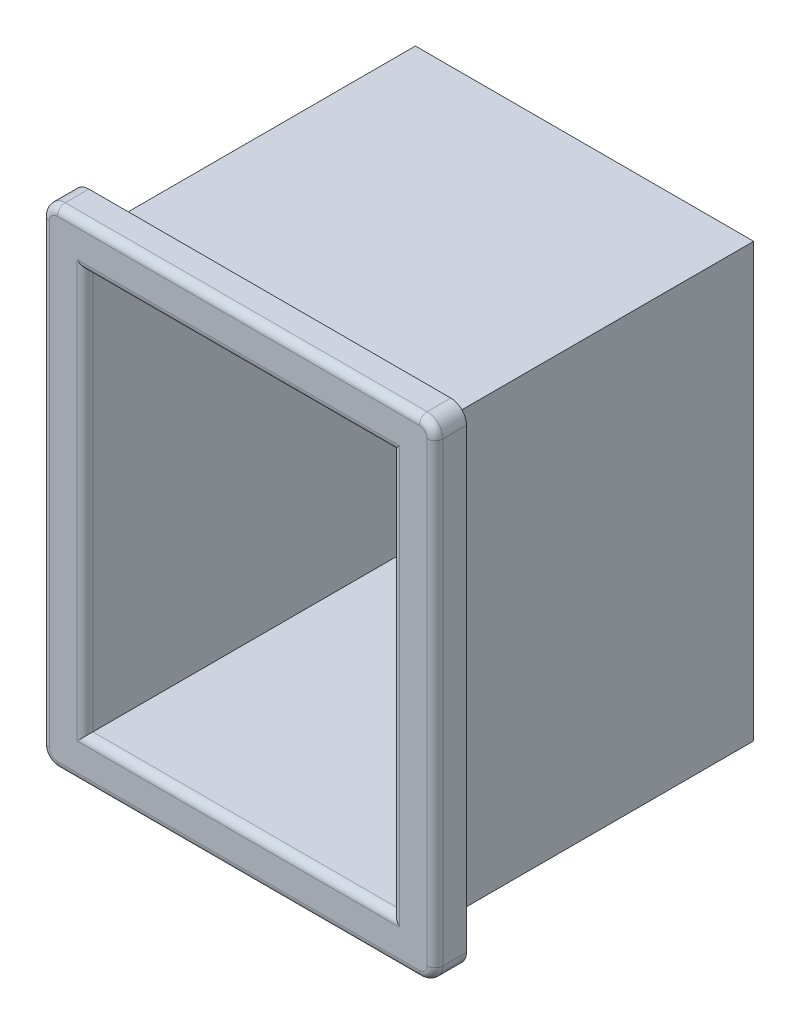
ISO-10303-21;
HEADER;
FILE_DESCRIPTION(('STEP AP214'),'2;1');
FILE_NAME('part.step','',(''),(''),'','','');
FILE_SCHEMA(('AUTOMOTIVE_DESIGN { 1 0 10303 214 1 1 1 1 }'));
ENDSEC;
DATA;
#1=APPLICATION_CONTEXT('core data for automotive mechanical design processes');
#2=APPLICATION_PROTOCOL_DEFINITION('international standard','automotive_design',2000,#1);
#3=PRODUCT_CONTEXT('',#1,'mechanical');
#4=PRODUCT('Part','Part','',(#3));
#5=PRODUCT_RELATED_PRODUCT_CATEGORY('part','',(#4));
#6=PRODUCT_DEFINITION_FORMATION('','',#4);
#7=PRODUCT_DEFINITION_CONTEXT('part definition',#1,'design');
#8=PRODUCT_DEFINITION('design','',#6,#7);
#9=PRODUCT_DEFINITION_SHAPE('','',#8);
#10=(LENGTH_UNIT() NAMED_UNIT(*) SI_UNIT(.MILLI.,.METRE.));
#11=(NAMED_UNIT(*) PLANE_ANGLE_UNIT() SI_UNIT($,.RADIAN.));
#12=(NAMED_UNIT(*) SI_UNIT($,.STERADIAN.) SOLID_ANGLE_UNIT());
#13=UNCERTAINTY_MEASURE_WITH_UNIT(LENGTH_MEASURE(1.E-05),#10,'distance_accuracy_value','');
#14=(GEOMETRIC_REPRESENTATION_CONTEXT(3) GLOBAL_UNCERTAINTY_ASSIGNED_CONTEXT((#13)) GLOBAL_UNIT_ASSIGNED_CONTEXT((#10,
#11,#12)) REPRESENTATION_CONTEXT('',''));
#15=CARTESIAN_POINT('',(0.,0.,0.));
#16=DIRECTION('',(0.,0.,1.));
#17=DIRECTION('',(1.,0.,0.));
#18=AXIS2_PLACEMENT_3D('',#15,#16,#17);
#19=CARTESIAN_POINT('',(10.75,13.75,20.));
#20=DIRECTION('',(-1.,0.,0.));
#21=DIRECTION('',(0.,-1.,0.));
#22=AXIS2_PLACEMENT_3D('',#19,#20,#21);
#23=PLANE('',#22);
#24=DIRECTION('',(0.,1.,0.));
#25=VECTOR('',#24,1.);
#26=CARTESIAN_POINT('',(10.75,13.75,0.));
#27=LINE('',#26,#25);
#28=CARTESIAN_POINT('',(10.75,-13.75,0.));
#29=VERTEX_POINT('',#28);
#30=CARTESIAN_POINT('',(10.75,13.75,0.));
#31=VERTEX_POINT('',#30);
#32=EDGE_CURVE('E229',#29,#31,#27,.T.);
#33=ORIENTED_EDGE('',*,*,#32,.T.);
#34=DIRECTION('',(0.,0.,-1.));
#35=VECTOR('',#34,1.);
#36=CARTESIAN_POINT('',(10.75,13.75,20.));
#37=LINE('',#36,#35);
#38=CARTESIAN_POINT('',(10.75,13.75,20.));
#39=VERTEX_POINT('',#38);
#40=EDGE_CURVE('E259',#39,#31,#37,.T.);
#41=ORIENTED_EDGE('',*,*,#40,.F.);
#42=DIRECTION('',(0.,1.,0.));
#43=VECTOR('',#42,1.);
#44=CARTESIAN_POINT('',(10.75,13.75,20.));
#45=LINE('',#44,#43);
#46=CARTESIAN_POINT('',(10.75,-13.75,20.));
#47=VERTEX_POINT('',#46);
#48=EDGE_CURVE('E230',#47,#39,#45,.T.);
#49=ORIENTED_EDGE('',*,*,#48,.F.);
#50=DIRECTION('',(0.,0.,-1.));
#51=VECTOR('',#50,1.);
#52=CARTESIAN_POINT('',(10.75,-13.75,20.));
#53=LINE('',#52,#51);
#54=EDGE_CURVE('E243',#47,#29,#53,.T.);
#55=ORIENTED_EDGE('',*,*,#54,.T.);
#56=EDGE_LOOP('',(#33,#41,#49,#55));
#57=FACE_BOUND('',#56,.T.);
#58=ADVANCED_FACE('F34',(#57),#23,.F.);
#59=CARTESIAN_POINT('',(-10.75,13.75,20.));
#60=DIRECTION('',(0.,-1.,0.));
#61=DIRECTION('',(0.,0.,-1.));
#62=AXIS2_PLACEMENT_3D('',#59,#60,#61);
#63=PLANE('',#62);
#64=DIRECTION('',(-1.,0.,0.));
#65=VECTOR('',#64,1.);
#66=CARTESIAN_POINT('',(-10.75,13.75,0.));
#67=LINE('',#66,#65);
#68=CARTESIAN_POINT('',(-10.75,13.75,0.));
#69=VERTEX_POINT('',#68);
#70=EDGE_CURVE('E246',#31,#69,#67,.T.);
#71=ORIENTED_EDGE('',*,*,#70,.T.);
#72=DIRECTION('',(0.,0.,-1.));
#73=VECTOR('',#72,1.);
#74=CARTESIAN_POINT('',(-10.75,13.75,20.));
#75=LINE('',#74,#73);
#76=CARTESIAN_POINT('',(-10.75,13.75,20.));
#77=VERTEX_POINT('',#76);
#78=EDGE_CURVE('E256',#77,#69,#75,.T.);
#79=ORIENTED_EDGE('',*,*,#78,.F.);
#80=DIRECTION('',(-1.,0.,0.));
#81=VECTOR('',#80,1.);
#82=CARTESIAN_POINT('',(-10.75,13.75,20.));
#83=LINE('',#82,#81);
#84=EDGE_CURVE('E233',#39,#77,#83,.T.);
#85=ORIENTED_EDGE('',*,*,#84,.F.);
#86=ORIENTED_EDGE('',*,*,#40,.T.);
#87=EDGE_LOOP('',(#71,#79,#85,#86));
#88=FACE_BOUND('',#87,.T.);
#89=ADVANCED_FACE('F394',(#88),#63,.F.);
#90=CARTESIAN_POINT('',(-10.75,13.75,20.));
#91=DIRECTION('',(1.,0.,0.));
#92=DIRECTION('',(0.,1.,0.));
#93=AXIS2_PLACEMENT_3D('',#90,#91,#92);
#94=PLANE('',#93);
#95=DIRECTION('',(0.,-1.,0.));
#96=VECTOR('',#95,1.);
#97=CARTESIAN_POINT('',(-10.75,13.75,0.));
#98=LINE('',#97,#96);
#99=CARTESIAN_POINT('',(-10.75,-13.75,0.));
#100=VERTEX_POINT('',#99);
#101=EDGE_CURVE('E248',#69,#100,#98,.T.);
#102=ORIENTED_EDGE('',*,*,#101,.T.);
#103=DIRECTION('',(0.,0.,-1.));
#104=VECTOR('',#103,1.);
#105=CARTESIAN_POINT('',(-10.75,-13.75,20.));
#106=LINE('',#105,#104);
#107=CARTESIAN_POINT('',(-10.75,-13.75,20.));
#108=VERTEX_POINT('',#107);
#109=EDGE_CURVE('E253',#108,#100,#106,.T.);
#110=ORIENTED_EDGE('',*,*,#109,.F.);
#111=DIRECTION('',(0.,-1.,0.));
#112=VECTOR('',#111,1.);
#113=CARTESIAN_POINT('',(-10.75,13.75,20.));
#114=LINE('',#113,#112);
#115=EDGE_CURVE('E237',#77,#108,#114,.T.);
#116=ORIENTED_EDGE('',*,*,#115,.F.);
#117=ORIENTED_EDGE('',*,*,#78,.T.);
#118=EDGE_LOOP('',(#102,#110,#116,#117));
#119=FACE_BOUND('',#118,.T.);
#120=ADVANCED_FACE('F400',(#119),#94,.F.);
#121=CARTESIAN_POINT('',(-10.75,-13.75,20.));
#122=DIRECTION('',(0.,1.,0.));
#123=DIRECTION('',(0.,0.,1.));
#124=AXIS2_PLACEMENT_3D('',#121,#122,#123);
#125=PLANE('',#124);
#126=DIRECTION('',(1.,0.,0.));
#127=VECTOR('',#126,1.);
#128=CARTESIAN_POINT('',(-10.75,-13.75,0.));
#129=LINE('',#128,#127);
#130=EDGE_CURVE('E234',#100,#29,#129,.T.);
#131=ORIENTED_EDGE('',*,*,#130,.T.);
#132=ORIENTED_EDGE('',*,*,#54,.F.);
#133=DIRECTION('',(1.,0.,0.));
#134=VECTOR('',#133,1.);
#135=CARTESIAN_POINT('',(-10.75,-13.75,20.));
#136=LINE('',#135,#134);
#137=EDGE_CURVE('E240',#108,#47,#136,.T.);
#138=ORIENTED_EDGE('',*,*,#137,.F.);
#139=ORIENTED_EDGE('',*,*,#109,.T.);
#140=EDGE_LOOP('',(#131,#132,#138,#139));
#141=FACE_BOUND('',#140,.T.);
#142=ADVANCED_FACE('F604',(#141),#125,.F.);
#143=CARTESIAN_POINT('',(0.,0.,0.));
#144=DIRECTION('',(0.,0.,1.));
#145=DIRECTION('',(1.,0.,0.));
#146=AXIS2_PLACEMENT_3D('',#143,#144,#145);
#147=PLANE('',#146);
#148=ORIENTED_EDGE('',*,*,#32,.F.);
#149=ORIENTED_EDGE('',*,*,#130,.F.);
#150=ORIENTED_EDGE('',*,*,#101,.F.);
#151=ORIENTED_EDGE('',*,*,#70,.F.);
#152=EDGE_LOOP('',(#148,#149,#150,#151));
#153=FACE_BOUND('',#152,.T.);
#154=ADVANCED_FACE('F587',(#153),#147,.F.);
#155=CARTESIAN_POINT('',(12.5,-15.5,22.));
#156=DIRECTION('',(-1.,0.,0.));
#157=DIRECTION('',(0.,0.,1.));
#158=AXIS2_PLACEMENT_3D('',#155,#156,#157);
#159=PLANE('',#158);
#160=DIRECTION('',(0.,0.,-1.));
#161=VECTOR('',#160,1.);
#162=CARTESIAN_POINT('',(12.5,14.5,22.));
#163=LINE('',#162,#161);
#164=CARTESIAN_POINT('',(12.5,14.5,20.));
#165=VERTEX_POINT('',#164);
#166=CARTESIAN_POINT('',(12.5,14.5,21.5));
#167=VERTEX_POINT('',#166);
#168=EDGE_CURVE('E280',#165,#167,#163,.F.);
#169=ORIENTED_EDGE('',*,*,#168,.T.);
#170=DIRECTION('',(0.,1.,0.));
#171=VECTOR('',#170,1.);
#172=CARTESIAN_POINT('',(12.5,-15.5,21.5));
#173=LINE('',#172,#171);
#174=CARTESIAN_POINT('',(12.5,-14.5,21.5));
#175=VERTEX_POINT('',#174);
#176=EDGE_CURVE('E323',#167,#175,#173,.F.);
#177=ORIENTED_EDGE('',*,*,#176,.T.);
#178=DIRECTION('',(0.,0.,-1.));
#179=VECTOR('',#178,1.);
#180=CARTESIAN_POINT('',(12.5,-14.5,22.));
#181=LINE('',#180,#179);
#182=CARTESIAN_POINT('',(12.5,-14.5,20.));
#183=VERTEX_POINT('',#182);
#184=EDGE_CURVE('E283',#175,#183,#181,.T.);
#185=ORIENTED_EDGE('',*,*,#184,.T.);
#186=DIRECTION('',(0.,1.,0.));
#187=VECTOR('',#186,1.);
#188=CARTESIAN_POINT('',(12.5,-15.5,20.));
#189=LINE('',#188,#187);
#190=EDGE_CURVE('E214',#183,#165,#189,.T.);
#191=ORIENTED_EDGE('',*,*,#190,.T.);
#192=EDGE_LOOP('',(#169,#177,#185,#191));
#193=FACE_BOUND('',#192,.T.);
#194=ADVANCED_FACE('F578',(#193),#159,.F.);
#195=CARTESIAN_POINT('',(-12.5,15.5,22.));
#196=DIRECTION('',(0.,-1.,0.));
#197=DIRECTION('',(0.,0.,-1.));
#198=AXIS2_PLACEMENT_3D('',#195,#196,#197);
#199=PLANE('',#198);
#200=DIRECTION('',(0.,0.,-1.));
#201=VECTOR('',#200,1.);
#202=CARTESIAN_POINT('',(-11.5,15.5,22.));
#203=LINE('',#202,#201);
#204=CARTESIAN_POINT('',(-11.5,15.5,20.));
#205=VERTEX_POINT('',#204);
#206=CARTESIAN_POINT('',(-11.5,15.5,21.5));
#207=VERTEX_POINT('',#206);
#208=EDGE_CURVE('E287',#205,#207,#203,.F.);
#209=ORIENTED_EDGE('',*,*,#208,.T.);
#210=DIRECTION('',(-1.,0.,0.));
#211=VECTOR('',#210,1.);
#212=CARTESIAN_POINT('',(-12.5,15.5,21.5));
#213=LINE('',#212,#211);
#214=CARTESIAN_POINT('',(11.5,15.5,21.5));
#215=VERTEX_POINT('',#214);
#216=EDGE_CURVE('E319',#207,#215,#213,.F.);
#217=ORIENTED_EDGE('',*,*,#216,.T.);
#218=DIRECTION('',(0.,0.,-1.));
#219=VECTOR('',#218,1.);
#220=CARTESIAN_POINT('',(11.5,15.5,22.));
#221=LINE('',#220,#219);
#222=CARTESIAN_POINT('',(11.5,15.5,20.));
#223=VERTEX_POINT('',#222);
#224=EDGE_CURVE('E285',#215,#223,#221,.T.);
#225=ORIENTED_EDGE('',*,*,#224,.T.);
#226=DIRECTION('',(-1.,0.,0.));
#227=VECTOR('',#226,1.);
#228=CARTESIAN_POINT('',(-12.5,15.5,20.));
#229=LINE('',#228,#227);
#230=EDGE_CURVE('E220',#223,#205,#229,.T.);
#231=ORIENTED_EDGE('',*,*,#230,.T.);
#232=EDGE_LOOP('',(#209,#217,#225,#231));
#233=FACE_BOUND('',#232,.T.);
#234=ADVANCED_FACE('F568',(#233),#199,.F.);
#235=CARTESIAN_POINT('',(-12.5,-15.5,22.));
#236=DIRECTION('',(1.,0.,0.));
#237=DIRECTION('',(0.,0.,-1.));
#238=AXIS2_PLACEMENT_3D('',#235,#236,#237);
#239=PLANE('',#238);
#240=DIRECTION('',(0.,0.,-1.));
#241=VECTOR('',#240,1.);
#242=CARTESIAN_POINT('',(-12.5,-14.5,22.));
#243=LINE('',#242,#241);
#244=CARTESIAN_POINT('',(-12.5,-14.5,20.));
#245=VERTEX_POINT('',#244);
#246=CARTESIAN_POINT('',(-12.5,-14.5,21.5));
#247=VERTEX_POINT('',#246);
#248=EDGE_CURVE('E277',#245,#247,#243,.F.);
#249=ORIENTED_EDGE('',*,*,#248,.T.);
#250=DIRECTION('',(0.,-1.,0.));
#251=VECTOR('',#250,1.);
#252=CARTESIAN_POINT('',(-12.5,-15.5,21.5));
#253=LINE('',#252,#251);
#254=CARTESIAN_POINT('',(-12.5,14.5,21.5));
#255=VERTEX_POINT('',#254);
#256=EDGE_CURVE('E331',#247,#255,#253,.F.);
#257=ORIENTED_EDGE('',*,*,#256,.T.);
#258=DIRECTION('',(0.,0.,-1.));
#259=VECTOR('',#258,1.);
#260=CARTESIAN_POINT('',(-12.5,14.5,22.));
#261=LINE('',#260,#259);
#262=CARTESIAN_POINT('',(-12.5,14.5,20.));
#263=VERTEX_POINT('',#262);
#264=EDGE_CURVE('E275',#255,#263,#261,.T.);
#265=ORIENTED_EDGE('',*,*,#264,.T.);
#266=DIRECTION('',(0.,-1.,0.));
#267=VECTOR('',#266,1.);
#268=CARTESIAN_POINT('',(-12.5,-15.5,20.));
#269=LINE('',#268,#267);
#270=EDGE_CURVE('E223',#263,#245,#269,.T.);
#271=ORIENTED_EDGE('',*,*,#270,.T.);
#272=EDGE_LOOP('',(#249,#257,#265,#271));
#273=FACE_BOUND('',#272,.T.);
#274=ADVANCED_FACE('F558',(#273),#239,.F.);
#275=CARTESIAN_POINT('',(-12.5,-15.5,22.));
#276=DIRECTION('',(0.,1.,0.));
#277=DIRECTION('',(0.,0.,1.));
#278=AXIS2_PLACEMENT_3D('',#275,#276,#277);
#279=PLANE('',#278);
#280=DIRECTION('',(0.,0.,-1.));
#281=VECTOR('',#280,1.);
#282=CARTESIAN_POINT('',(11.5,-15.5,22.));
#283=LINE('',#282,#281);
#284=CARTESIAN_POINT('',(11.5,-15.5,20.));
#285=VERTEX_POINT('',#284);
#286=CARTESIAN_POINT('',(11.5,-15.5,21.5));
#287=VERTEX_POINT('',#286);
#288=EDGE_CURVE('E262',#285,#287,#283,.F.);
#289=ORIENTED_EDGE('',*,*,#288,.T.);
#290=DIRECTION('',(1.,0.,0.));
#291=VECTOR('',#290,1.);
#292=CARTESIAN_POINT('',(-12.5,-15.5,21.5));
#293=LINE('',#292,#291);
#294=CARTESIAN_POINT('',(-11.5,-15.5,21.5));
#295=VERTEX_POINT('',#294);
#296=EDGE_CURVE('E327',#287,#295,#293,.F.);
#297=ORIENTED_EDGE('',*,*,#296,.T.);
#298=DIRECTION('',(0.,0.,-1.));
#299=VECTOR('',#298,1.);
#300=CARTESIAN_POINT('',(-11.5,-15.5,22.));
#301=LINE('',#300,#299);
#302=CARTESIAN_POINT('',(-11.5,-15.5,20.));
#303=VERTEX_POINT('',#302);
#304=EDGE_CURVE('E265',#295,#303,#301,.T.);
#305=ORIENTED_EDGE('',*,*,#304,.T.);
#306=DIRECTION('',(1.,0.,0.));
#307=VECTOR('',#306,1.);
#308=CARTESIAN_POINT('',(-12.5,-15.5,20.));
#309=LINE('',#308,#307);
#310=EDGE_CURVE('E226',#303,#285,#309,.T.);
#311=ORIENTED_EDGE('',*,*,#310,.T.);
#312=EDGE_LOOP('',(#289,#297,#305,#311));
#313=FACE_BOUND('',#312,.T.);
#314=ADVANCED_FACE('F548',(#313),#279,.F.);
#315=CARTESIAN_POINT('',(0.,0.,22.));
#316=DIRECTION('',(0.,0.,-1.));
#317=DIRECTION('',(-1.,0.,0.));
#318=AXIS2_PLACEMENT_3D('',#315,#316,#317);
#319=PLANE('',#318);
#320=DIRECTION('',(-1.,0.,0.));
#321=VECTOR('',#320,1.);
#322=CARTESIAN_POINT('',(0.,15.,22.));
#323=LINE('',#322,#321);
#324=CARTESIAN_POINT('',(11.5,15.,22.));
#325=VERTEX_POINT('',#324);
#326=CARTESIAN_POINT('',(-11.5,15.,22.));
#327=VERTEX_POINT('',#326);
#328=EDGE_CURVE('E311',#325,#327,#323,.T.);
#329=ORIENTED_EDGE('',*,*,#328,.T.);
#330=CARTESIAN_POINT('',(-11.5,14.5,22.));
#331=DIRECTION('',(0.,0.,-1.));
#332=DIRECTION('',(-1.,0.,0.));
#333=AXIS2_PLACEMENT_3D('',#330,#331,#332);
#334=CIRCLE('',#333,0.5);
#335=CARTESIAN_POINT('',(-12.,14.5,22.));
#336=VERTEX_POINT('',#335);
#337=EDGE_CURVE('E313',#327,#336,#334,.F.);
#338=ORIENTED_EDGE('',*,*,#337,.T.);
#339=DIRECTION('',(0.,-1.,0.));
#340=VECTOR('',#339,1.);
#341=CARTESIAN_POINT('',(-12.,0.,22.));
#342=LINE('',#341,#340);
#343=CARTESIAN_POINT('',(-12.,-14.5,22.));
#344=VERTEX_POINT('',#343);
#345=EDGE_CURVE('E299',#336,#344,#342,.T.);
#346=ORIENTED_EDGE('',*,*,#345,.T.);
#347=CARTESIAN_POINT('',(-11.5,-14.5,22.));
#348=DIRECTION('',(0.,0.,-1.));
#349=DIRECTION('',(-1.,0.,0.));
#350=AXIS2_PLACEMENT_3D('',#347,#348,#349);
#351=CIRCLE('',#350,0.5);
#352=CARTESIAN_POINT('',(-11.5,-15.,22.));
#353=VERTEX_POINT('',#352);
#354=EDGE_CURVE('E301',#344,#353,#351,.F.);
#355=ORIENTED_EDGE('',*,*,#354,.T.);
#356=DIRECTION('',(1.,0.,0.));
#357=VECTOR('',#356,1.);
#358=CARTESIAN_POINT('',(0.,-15.,22.));
#359=LINE('',#358,#357);
#360=CARTESIAN_POINT('',(11.5,-15.,22.));
#361=VERTEX_POINT('',#360);
#362=EDGE_CURVE('E303',#353,#361,#359,.T.);
#363=ORIENTED_EDGE('',*,*,#362,.T.);
#364=CARTESIAN_POINT('',(11.5,-14.5,22.));
#365=DIRECTION('',(0.,0.,-1.));
#366=DIRECTION('',(-1.,0.,0.));
#367=AXIS2_PLACEMENT_3D('',#364,#365,#366);
#368=CIRCLE('',#367,0.5);
#369=CARTESIAN_POINT('',(12.,-14.5,22.));
#370=VERTEX_POINT('',#369);
#371=EDGE_CURVE('E305',#361,#370,#368,.F.);
#372=ORIENTED_EDGE('',*,*,#371,.T.);
#373=DIRECTION('',(0.,1.,0.));
#374=VECTOR('',#373,1.);
#375=CARTESIAN_POINT('',(12.,0.,22.));
#376=LINE('',#375,#374);
#377=CARTESIAN_POINT('',(12.,14.5,22.));
#378=VERTEX_POINT('',#377);
#379=EDGE_CURVE('E307',#370,#378,#376,.T.);
#380=ORIENTED_EDGE('',*,*,#379,.T.);
#381=CARTESIAN_POINT('',(11.5,14.5,22.));
#382=DIRECTION('',(0.,0.,-1.));
#383=DIRECTION('',(-1.,0.,0.));
#384=AXIS2_PLACEMENT_3D('',#381,#382,#383);
#385=CIRCLE('',#384,0.5);
#386=EDGE_CURVE('E309',#378,#325,#385,.F.);
#387=ORIENTED_EDGE('',*,*,#386,.T.);
#388=EDGE_LOOP('',(#329,#338,#346,#355,#363,#372,#380,#387));
#389=FACE_BOUND('',#388,.T.);
#390=DIRECTION('',(1.,0.,0.));
#391=VECTOR('',#390,1.);
#392=CARTESIAN_POINT('',(0.,-13.25,22.));
#393=LINE('',#392,#391);
#394=CARTESIAN_POINT('',(10.25,-13.25,22.));
#395=VERTEX_POINT('',#394);
#396=CARTESIAN_POINT('',(-10.25,-13.25,22.));
#397=VERTEX_POINT('',#396);
#398=EDGE_CURVE('E294',#395,#397,#393,.F.);
#399=ORIENTED_EDGE('',*,*,#398,.T.);
#400=DIRECTION('',(0.,-1.,0.));
#401=VECTOR('',#400,1.);
#402=CARTESIAN_POINT('',(-10.25,0.,22.));
#403=LINE('',#402,#401);
#404=CARTESIAN_POINT('',(-10.25,13.25,22.));
#405=VERTEX_POINT('',#404);
#406=EDGE_CURVE('E296',#397,#405,#403,.F.);
#407=ORIENTED_EDGE('',*,*,#406,.T.);
#408=DIRECTION('',(-1.,0.,0.));
#409=VECTOR('',#408,1.);
#410=CARTESIAN_POINT('',(0.,13.25,22.));
#411=LINE('',#410,#409);
#412=CARTESIAN_POINT('',(10.25,13.25,22.));
#413=VERTEX_POINT('',#412);
#414=EDGE_CURVE('E290',#405,#413,#411,.F.);
#415=ORIENTED_EDGE('',*,*,#414,.T.);
#416=DIRECTION('',(0.,1.,0.));
#417=VECTOR('',#416,1.);
#418=CARTESIAN_POINT('',(10.25,0.,22.));
#419=LINE('',#418,#417);
#420=EDGE_CURVE('E292',#413,#395,#419,.F.);
#421=ORIENTED_EDGE('',*,*,#420,.T.);
#422=EDGE_LOOP('',(#399,#407,#415,#421));
#423=FACE_BOUND('',#422,.T.);
#424=ADVANCED_FACE('F373',(#389,#423),#319,.F.);
#425=CARTESIAN_POINT('',(0.,0.,20.));
#426=DIRECTION('',(0.,0.,-1.));
#427=DIRECTION('',(-1.,0.,0.));
#428=AXIS2_PLACEMENT_3D('',#425,#426,#427);
#429=PLANE('',#428);
#430=ORIENTED_EDGE('',*,*,#137,.T.);
#431=ORIENTED_EDGE('',*,*,#48,.T.);
#432=ORIENTED_EDGE('',*,*,#84,.T.);
#433=ORIENTED_EDGE('',*,*,#115,.T.);
#434=EDGE_LOOP('',(#430,#431,#432,#433));
#435=FACE_BOUND('',#434,.T.);
#436=ORIENTED_EDGE('',*,*,#310,.F.);
#437=CARTESIAN_POINT('',(-11.5,-14.5,20.));
#438=DIRECTION('',(0.,0.,-1.));
#439=DIRECTION('',(-1.,0.,0.));
#440=AXIS2_PLACEMENT_3D('',#437,#438,#439);
#441=CIRCLE('',#440,1.);
#442=EDGE_CURVE('E273',#303,#245,#441,.T.);
#443=ORIENTED_EDGE('',*,*,#442,.T.);
#444=ORIENTED_EDGE('',*,*,#270,.F.);
#445=CARTESIAN_POINT('',(-11.5,14.5,20.));
#446=DIRECTION('',(0.,0.,-1.));
#447=DIRECTION('',(-1.,0.,0.));
#448=AXIS2_PLACEMENT_3D('',#445,#446,#447);
#449=CIRCLE('',#448,1.);
#450=EDGE_CURVE('E269',#263,#205,#449,.T.);
#451=ORIENTED_EDGE('',*,*,#450,.T.);
#452=ORIENTED_EDGE('',*,*,#230,.F.);
#453=CARTESIAN_POINT('',(11.5,14.5,20.));
#454=DIRECTION('',(0.,0.,-1.));
#455=DIRECTION('',(-1.,0.,0.));
#456=AXIS2_PLACEMENT_3D('',#453,#454,#455);
#457=CIRCLE('',#456,1.);
#458=EDGE_CURVE('E267',#223,#165,#457,.T.);
#459=ORIENTED_EDGE('',*,*,#458,.T.);
#460=ORIENTED_EDGE('',*,*,#190,.F.);
#461=CARTESIAN_POINT('',(11.5,-14.5,20.));
#462=DIRECTION('',(0.,0.,-1.));
#463=DIRECTION('',(-1.,0.,0.));
#464=AXIS2_PLACEMENT_3D('',#461,#462,#463);
#465=CIRCLE('',#464,1.);
#466=EDGE_CURVE('E271',#183,#285,#465,.T.);
#467=ORIENTED_EDGE('',*,*,#466,.T.);
#468=EDGE_LOOP('',(#436,#443,#444,#451,#452,#459,#460,#467));
#469=FACE_BOUND('',#468,.T.);
#470=ADVANCED_FACE('F390',(#435,#469),#429,.T.);
#471=CARTESIAN_POINT('',(9.75,-12.75,0.999999999999997));
#472=DIRECTION('',(1.,0.,0.));
#473=DIRECTION('',(0.,0.,-1.));
#474=AXIS2_PLACEMENT_3D('',#471,#472,#473);
#475=PLANE('',#474);
#476=DIRECTION('',(0.,0.,1.));
#477=VECTOR('',#476,1.);
#478=CARTESIAN_POINT('',(9.75,-12.75,0.999999999999997));
#479=LINE('',#478,#477);
#480=CARTESIAN_POINT('',(9.75,-12.75,0.999999999999997));
#481=VERTEX_POINT('',#480);
#482=CARTESIAN_POINT('',(9.75,-12.75,21.5));
#483=VERTEX_POINT('',#482);
#484=EDGE_CURVE('E212',#481,#483,#479,.T.);
#485=ORIENTED_EDGE('',*,*,#484,.T.);
#486=DIRECTION('',(0.,1.,0.));
#487=VECTOR('',#486,1.);
#488=CARTESIAN_POINT('',(9.75,-12.75,21.5));
#489=LINE('',#488,#487);
#490=CARTESIAN_POINT('',(9.75,12.75,21.5));
#491=VERTEX_POINT('',#490);
#492=EDGE_CURVE('E43',#483,#491,#489,.T.);
#493=ORIENTED_EDGE('',*,*,#492,.T.);
#494=DIRECTION('',(0.,0.,1.));
#495=VECTOR('',#494,1.);
#496=CARTESIAN_POINT('',(9.75,12.75,0.999999999999997));
#497=LINE('',#496,#495);
#498=CARTESIAN_POINT('',(9.75,12.75,0.999999999999997));
#499=VERTEX_POINT('',#498);
#500=EDGE_CURVE('E182',#499,#491,#497,.T.);
#501=ORIENTED_EDGE('',*,*,#500,.F.);
#502=DIRECTION('',(0.,1.,0.));
#503=VECTOR('',#502,1.);
#504=CARTESIAN_POINT('',(9.75,-12.75,0.999999999999997));
#505=LINE('',#504,#503);
#506=EDGE_CURVE('E186',#481,#499,#505,.T.);
#507=ORIENTED_EDGE('',*,*,#506,.F.);
#508=EDGE_LOOP('',(#485,#493,#501,#507));
#509=FACE_BOUND('',#508,.T.);
#510=ADVANCED_FACE('F184',(#509),#475,.F.);
#511=CARTESIAN_POINT('',(-9.75,-12.75,0.999999999999997));
#512=DIRECTION('',(0.,-1.,0.));
#513=DIRECTION('',(0.,0.,-1.));
#514=AXIS2_PLACEMENT_3D('',#511,#512,#513);
#515=PLANE('',#514);
#516=DIRECTION('',(0.,0.,1.));
#517=VECTOR('',#516,1.);
#518=CARTESIAN_POINT('',(-9.75,-12.75,0.999999999999997));
#519=LINE('',#518,#517);
#520=CARTESIAN_POINT('',(-9.75,-12.75,0.999999999999997));
#521=VERTEX_POINT('',#520);
#522=CARTESIAN_POINT('',(-9.75,-12.75,21.5));
#523=VERTEX_POINT('',#522);
#524=EDGE_CURVE('E215',#521,#523,#519,.T.);
#525=ORIENTED_EDGE('',*,*,#524,.T.);
#526=DIRECTION('',(1.,0.,0.));
#527=VECTOR('',#526,1.);
#528=CARTESIAN_POINT('',(-9.75,-12.75,21.5));
#529=LINE('',#528,#527);
#530=EDGE_CURVE('E58',#523,#483,#529,.T.);
#531=ORIENTED_EDGE('',*,*,#530,.T.);
#532=ORIENTED_EDGE('',*,*,#484,.F.);
#533=DIRECTION('',(1.,0.,0.));
#534=VECTOR('',#533,1.);
#535=CARTESIAN_POINT('',(-9.75,-12.75,0.999999999999997));
#536=LINE('',#535,#534);
#537=EDGE_CURVE('E191',#521,#481,#536,.T.);
#538=ORIENTED_EDGE('',*,*,#537,.F.);
#539=EDGE_LOOP('',(#525,#531,#532,#538));
#540=FACE_BOUND('',#539,.T.);
#541=ADVANCED_FACE('F382',(#540),#515,.F.);
#542=CARTESIAN_POINT('',(-9.75,-12.75,0.999999999999997));
#543=DIRECTION('',(-1.,0.,0.));
#544=DIRECTION('',(0.,0.,1.));
#545=AXIS2_PLACEMENT_3D('',#542,#543,#544);
#546=PLANE('',#545);
#547=DIRECTION('',(0.,0.,1.));
#548=VECTOR('',#547,1.);
#549=CARTESIAN_POINT('',(-9.75,12.75,0.999999999999997));
#550=LINE('',#549,#548);
#551=CARTESIAN_POINT('',(-9.75,12.75,0.999999999999997));
#552=VERTEX_POINT('',#551);
#553=CARTESIAN_POINT('',(-9.75,12.75,21.5));
#554=VERTEX_POINT('',#553);
#555=EDGE_CURVE('E190',#552,#554,#550,.T.);
#556=ORIENTED_EDGE('',*,*,#555,.T.);
#557=DIRECTION('',(0.,-1.,0.));
#558=VECTOR('',#557,1.);
#559=CARTESIAN_POINT('',(-9.75,-12.75,21.5));
#560=LINE('',#559,#558);
#561=EDGE_CURVE('E333',#554,#523,#560,.T.);
#562=ORIENTED_EDGE('',*,*,#561,.T.);
#563=ORIENTED_EDGE('',*,*,#524,.F.);
#564=DIRECTION('',(0.,-1.,0.));
#565=VECTOR('',#564,1.);
#566=CARTESIAN_POINT('',(-9.75,-12.75,0.999999999999997));
#567=LINE('',#566,#565);
#568=EDGE_CURVE('E200',#552,#521,#567,.T.);
#569=ORIENTED_EDGE('',*,*,#568,.F.);
#570=EDGE_LOOP('',(#556,#562,#563,#569));
#571=FACE_BOUND('',#570,.T.);
#572=ADVANCED_FACE('F381',(#571),#546,.F.);
#573=CARTESIAN_POINT('',(-9.75,12.75,0.999999999999997));
#574=DIRECTION('',(0.,1.,0.));
#575=DIRECTION('',(0.,0.,1.));
#576=AXIS2_PLACEMENT_3D('',#573,#574,#575);
#577=PLANE('',#576);
#578=ORIENTED_EDGE('',*,*,#500,.T.);
#579=DIRECTION('',(-1.,0.,0.));
#580=VECTOR('',#579,1.);
#581=CARTESIAN_POINT('',(-9.75,12.75,21.5));
#582=LINE('',#581,#580);
#583=EDGE_CURVE('E11',#491,#554,#582,.T.);
#584=ORIENTED_EDGE('',*,*,#583,.T.);
#585=ORIENTED_EDGE('',*,*,#555,.F.);
#586=DIRECTION('',(-1.,0.,0.));
#587=VECTOR('',#586,1.);
#588=CARTESIAN_POINT('',(-9.75,12.75,0.999999999999997));
#589=LINE('',#588,#587);
#590=EDGE_CURVE('E194',#499,#552,#589,.T.);
#591=ORIENTED_EDGE('',*,*,#590,.F.);
#592=EDGE_LOOP('',(#578,#584,#585,#591));
#593=FACE_BOUND('',#592,.T.);
#594=ADVANCED_FACE('F195',(#593),#577,.F.);
#595=CARTESIAN_POINT('',(0.,0.,0.999999999999997));
#596=DIRECTION('',(0.,0.,-1.));
#597=DIRECTION('',(-1.,0.,0.));
#598=AXIS2_PLACEMENT_3D('',#595,#596,#597);
#599=PLANE('',#598);
#600=ORIENTED_EDGE('',*,*,#506,.T.);
#601=ORIENTED_EDGE('',*,*,#590,.T.);
#602=ORIENTED_EDGE('',*,*,#568,.T.);
#603=ORIENTED_EDGE('',*,*,#537,.T.);
#604=EDGE_LOOP('',(#600,#601,#602,#603));
#605=FACE_BOUND('',#604,.T.);
#606=ADVANCED_FACE('F202',(#605),#599,.F.);
#607=CARTESIAN_POINT('',(-11.5,-14.5,22.));
#608=DIRECTION('',(0.,0.,-1.));
#609=DIRECTION('',(-1.,0.,0.));
#610=AXIS2_PLACEMENT_3D('',#607,#608,#609);
#611=CYLINDRICAL_SURFACE('',#610,1.);
#612=ORIENTED_EDGE('',*,*,#304,.F.);
#613=CARTESIAN_POINT('',(-11.5,-14.5,21.5));
#614=DIRECTION('',(0.,0.,-1.));
#615=DIRECTION('',(-1.,0.,0.));
#616=AXIS2_PLACEMENT_3D('',#613,#614,#615);
#617=CIRCLE('',#616,1.);
#618=EDGE_CURVE('E329',#295,#247,#617,.T.);
#619=ORIENTED_EDGE('',*,*,#618,.T.);
#620=ORIENTED_EDGE('',*,*,#248,.F.);
#621=ORIENTED_EDGE('',*,*,#442,.F.);
#622=EDGE_LOOP('',(#612,#619,#620,#621));
#623=FACE_BOUND('',#622,.T.);
#624=ADVANCED_FACE('F405',(#623),#611,.T.);
#625=CARTESIAN_POINT('',(11.5,-14.5,22.));
#626=DIRECTION('',(0.,0.,-1.));
#627=DIRECTION('',(-1.,0.,0.));
#628=AXIS2_PLACEMENT_3D('',#625,#626,#627);
#629=CYLINDRICAL_SURFACE('',#628,1.);
#630=ORIENTED_EDGE('',*,*,#184,.F.);
#631=CARTESIAN_POINT('',(11.5,-14.5,21.5));
#632=DIRECTION('',(0.,0.,-1.));
#633=DIRECTION('',(-1.,0.,0.));
#634=AXIS2_PLACEMENT_3D('',#631,#632,#633);
#635=CIRCLE('',#634,1.);
#636=EDGE_CURVE('E325',#175,#287,#635,.T.);
#637=ORIENTED_EDGE('',*,*,#636,.T.);
#638=ORIENTED_EDGE('',*,*,#288,.F.);
#639=ORIENTED_EDGE('',*,*,#466,.F.);
#640=EDGE_LOOP('',(#630,#637,#638,#639));
#641=FACE_BOUND('',#640,.T.);
#642=ADVANCED_FACE('F408',(#641),#629,.T.);
#643=CARTESIAN_POINT('',(-11.5,14.5,22.));
#644=DIRECTION('',(0.,0.,-1.));
#645=DIRECTION('',(-1.,0.,0.));
#646=AXIS2_PLACEMENT_3D('',#643,#644,#645);
#647=CYLINDRICAL_SURFACE('',#646,1.);
#648=ORIENTED_EDGE('',*,*,#264,.F.);
#649=CARTESIAN_POINT('',(-11.5,14.5,21.5));
#650=DIRECTION('',(0.,0.,-1.));
#651=DIRECTION('',(-1.,0.,0.));
#652=AXIS2_PLACEMENT_3D('',#649,#650,#651);
#653=CIRCLE('',#652,1.);
#654=EDGE_CURVE('E316',#255,#207,#653,.T.);
#655=ORIENTED_EDGE('',*,*,#654,.T.);
#656=ORIENTED_EDGE('',*,*,#208,.F.);
#657=ORIENTED_EDGE('',*,*,#450,.F.);
#658=EDGE_LOOP('',(#648,#655,#656,#657));
#659=FACE_BOUND('',#658,.T.);
#660=ADVANCED_FACE('F412',(#659),#647,.T.);
#661=CARTESIAN_POINT('',(11.5,14.5,22.));
#662=DIRECTION('',(0.,0.,-1.));
#663=DIRECTION('',(-1.,0.,0.));
#664=AXIS2_PLACEMENT_3D('',#661,#662,#663);
#665=CYLINDRICAL_SURFACE('',#664,1.);
#666=ORIENTED_EDGE('',*,*,#224,.F.);
#667=CARTESIAN_POINT('',(11.5,14.5,21.5));
#668=DIRECTION('',(0.,0.,-1.));
#669=DIRECTION('',(-1.,0.,0.));
#670=AXIS2_PLACEMENT_3D('',#667,#668,#669);
#671=CIRCLE('',#670,1.);
#672=EDGE_CURVE('E321',#215,#167,#671,.T.);
#673=ORIENTED_EDGE('',*,*,#672,.T.);
#674=ORIENTED_EDGE('',*,*,#168,.F.);
#675=ORIENTED_EDGE('',*,*,#458,.F.);
#676=EDGE_LOOP('',(#666,#673,#674,#675));
#677=FACE_BOUND('',#676,.T.);
#678=ADVANCED_FACE('F416',(#677),#665,.T.);
#679=CARTESIAN_POINT('',(11.5,-14.5,21.5));
#680=DIRECTION('',(0.,0.,-1.));
#681=DIRECTION('',(-1.,0.,0.));
#682=AXIS2_PLACEMENT_3D('',#679,#680,#681);
#683=DEGENERATE_TOROIDAL_SURFACE('',#682,0.5,0.5,.T.);
#684=CARTESIAN_POINT('',(11.5,-15.,21.5));
#685=DIRECTION('',(-1.,0.,0.));
#686=DIRECTION('',(0.,0.,1.));
#687=AXIS2_PLACEMENT_3D('',#684,#685,#686);
#688=CIRCLE('',#687,0.5);
#689=EDGE_CURVE('E207',#287,#361,#688,.T.);
#690=ORIENTED_EDGE('',*,*,#689,.F.);
#691=ORIENTED_EDGE('',*,*,#636,.F.);
#692=CARTESIAN_POINT('',(12.,-14.5,21.5));
#693=DIRECTION('',(0.,1.,0.));
#694=DIRECTION('',(0.,0.,1.));
#695=AXIS2_PLACEMENT_3D('',#692,#693,#694);
#696=CIRCLE('',#695,0.5);
#697=EDGE_CURVE('E204',#370,#175,#696,.T.);
#698=ORIENTED_EDGE('',*,*,#697,.F.);
#699=ORIENTED_EDGE('',*,*,#371,.F.);
#700=EDGE_LOOP('',(#690,#691,#698,#699));
#701=FACE_BOUND('',#700,.T.);
#702=ADVANCED_FACE('F420',(#701),#683,.T.);
#703=CARTESIAN_POINT('',(12.,0.,21.5));
#704=DIRECTION('',(0.,1.,0.));
#705=DIRECTION('',(0.,0.,1.));
#706=AXIS2_PLACEMENT_3D('',#703,#704,#705);
#707=CYLINDRICAL_SURFACE('',#706,0.5);
#708=ORIENTED_EDGE('',*,*,#697,.T.);
#709=ORIENTED_EDGE('',*,*,#176,.F.);
#710=CARTESIAN_POINT('',(12.,14.5,21.5));
#711=DIRECTION('',(0.,1.,0.));
#712=DIRECTION('',(0.,0.,1.));
#713=AXIS2_PLACEMENT_3D('',#710,#711,#712);
#714=CIRCLE('',#713,0.5);
#715=EDGE_CURVE('E351',#378,#167,#714,.T.);
#716=ORIENTED_EDGE('',*,*,#715,.F.);
#717=ORIENTED_EDGE('',*,*,#379,.F.);
#718=EDGE_LOOP('',(#708,#709,#716,#717));
#719=FACE_BOUND('',#718,.T.);
#720=ADVANCED_FACE('F445',(#719),#707,.T.);
#721=CARTESIAN_POINT('',(0.,-15.,21.5));
#722=DIRECTION('',(1.,0.,0.));
#723=DIRECTION('',(0.,0.,-1.));
#724=AXIS2_PLACEMENT_3D('',#721,#722,#723);
#725=CYLINDRICAL_SURFACE('',#724,0.5);
#726=ORIENTED_EDGE('',*,*,#689,.T.);
#727=ORIENTED_EDGE('',*,*,#362,.F.);
#728=CARTESIAN_POINT('',(-11.5,-15.,21.5));
#729=DIRECTION('',(-1.,0.,0.));
#730=DIRECTION('',(0.,0.,1.));
#731=AXIS2_PLACEMENT_3D('',#728,#729,#730);
#732=CIRCLE('',#731,0.5);
#733=EDGE_CURVE('E348',#295,#353,#732,.T.);
#734=ORIENTED_EDGE('',*,*,#733,.F.);
#735=ORIENTED_EDGE('',*,*,#296,.F.);
#736=EDGE_LOOP('',(#726,#727,#734,#735));
#737=FACE_BOUND('',#736,.T.);
#738=ADVANCED_FACE('F441',(#737),#725,.T.);
#739=CARTESIAN_POINT('',(11.5,14.5,21.5));
#740=DIRECTION('',(0.,0.,-1.));
#741=DIRECTION('',(-1.,0.,0.));
#742=AXIS2_PLACEMENT_3D('',#739,#740,#741);
#743=DEGENERATE_TOROIDAL_SURFACE('',#742,0.5,0.5,.T.);
#744=ORIENTED_EDGE('',*,*,#715,.T.);
#745=ORIENTED_EDGE('',*,*,#672,.F.);
#746=CARTESIAN_POINT('',(11.5,15.,21.5));
#747=DIRECTION('',(-1.,0.,0.));
#748=DIRECTION('',(0.,0.,1.));
#749=AXIS2_PLACEMENT_3D('',#746,#747,#748);
#750=CIRCLE('',#749,0.5);
#751=EDGE_CURVE('E345',#325,#215,#750,.T.);
#752=ORIENTED_EDGE('',*,*,#751,.F.);
#753=ORIENTED_EDGE('',*,*,#386,.F.);
#754=EDGE_LOOP('',(#744,#745,#752,#753));
#755=FACE_BOUND('',#754,.T.);
#756=ADVANCED_FACE('F437',(#755),#743,.T.);
#757=CARTESIAN_POINT('',(-11.5,-14.5,21.5));
#758=DIRECTION('',(0.,0.,-1.));
#759=DIRECTION('',(-1.,0.,0.));
#760=AXIS2_PLACEMENT_3D('',#757,#758,#759);
#761=DEGENERATE_TOROIDAL_SURFACE('',#760,0.5,0.5,.T.);
#762=ORIENTED_EDGE('',*,*,#733,.T.);
#763=ORIENTED_EDGE('',*,*,#354,.F.);
#764=CARTESIAN_POINT('',(-12.,-14.5,21.5));
#765=DIRECTION('',(0.,1.,0.));
#766=DIRECTION('',(0.,0.,1.));
#767=AXIS2_PLACEMENT_3D('',#764,#765,#766);
#768=CIRCLE('',#767,0.5);
#769=EDGE_CURVE('E342',#247,#344,#768,.T.);
#770=ORIENTED_EDGE('',*,*,#769,.F.);
#771=ORIENTED_EDGE('',*,*,#618,.F.);
#772=EDGE_LOOP('',(#762,#763,#770,#771));
#773=FACE_BOUND('',#772,.T.);
#774=ADVANCED_FACE('F433',(#773),#761,.T.);
#775=CARTESIAN_POINT('',(0.,15.,21.5));
#776=DIRECTION('',(-1.,0.,0.));
#777=DIRECTION('',(0.,0.,1.));
#778=AXIS2_PLACEMENT_3D('',#775,#776,#777);
#779=CYLINDRICAL_SURFACE('',#778,0.5);
#780=ORIENTED_EDGE('',*,*,#751,.T.);
#781=ORIENTED_EDGE('',*,*,#216,.F.);
#782=CARTESIAN_POINT('',(-11.5,15.,21.5));
#783=DIRECTION('',(-1.,0.,0.));
#784=DIRECTION('',(0.,0.,1.));
#785=AXIS2_PLACEMENT_3D('',#782,#783,#784);
#786=CIRCLE('',#785,0.5);
#787=EDGE_CURVE('E340',#327,#207,#786,.T.);
#788=ORIENTED_EDGE('',*,*,#787,.F.);
#789=ORIENTED_EDGE('',*,*,#328,.F.);
#790=EDGE_LOOP('',(#780,#781,#788,#789));
#791=FACE_BOUND('',#790,.T.);
#792=ADVANCED_FACE('F429',(#791),#779,.T.);
#793=CARTESIAN_POINT('',(-12.,0.,21.5));
#794=DIRECTION('',(0.,-1.,0.));
#795=DIRECTION('',(0.,0.,-1.));
#796=AXIS2_PLACEMENT_3D('',#793,#794,#795);
#797=CYLINDRICAL_SURFACE('',#796,0.5);
#798=ORIENTED_EDGE('',*,*,#769,.T.);
#799=ORIENTED_EDGE('',*,*,#345,.F.);
#800=CARTESIAN_POINT('',(-12.,14.5,21.5));
#801=DIRECTION('',(0.,1.,0.));
#802=DIRECTION('',(0.,0.,1.));
#803=AXIS2_PLACEMENT_3D('',#800,#801,#802);
#804=CIRCLE('',#803,0.5);
#805=EDGE_CURVE('E338',#255,#336,#804,.T.);
#806=ORIENTED_EDGE('',*,*,#805,.F.);
#807=ORIENTED_EDGE('',*,*,#256,.F.);
#808=EDGE_LOOP('',(#798,#799,#806,#807));
#809=FACE_BOUND('',#808,.T.);
#810=ADVANCED_FACE('F425',(#809),#797,.T.);
#811=CARTESIAN_POINT('',(-11.5,14.5,21.5));
#812=DIRECTION('',(0.,0.,-1.));
#813=DIRECTION('',(-1.,0.,0.));
#814=AXIS2_PLACEMENT_3D('',#811,#812,#813);
#815=DEGENERATE_TOROIDAL_SURFACE('',#814,0.5,0.5,.T.);
#816=ORIENTED_EDGE('',*,*,#787,.T.);
#817=ORIENTED_EDGE('',*,*,#654,.F.);
#818=ORIENTED_EDGE('',*,*,#805,.T.);
#819=ORIENTED_EDGE('',*,*,#337,.F.);
#820=EDGE_LOOP('',(#816,#817,#818,#819));
#821=FACE_BOUND('',#820,.T.);
#822=ADVANCED_FACE('F422',(#821),#815,.T.);
#823=CARTESIAN_POINT('',(10.25,-12.75,21.5));
#824=DIRECTION('',(0.,1.,0.));
#825=DIRECTION('',(0.,0.,1.));
#826=AXIS2_PLACEMENT_3D('',#823,#824,#825);
#827=CYLINDRICAL_SURFACE('',#826,0.5);
#828=CARTESIAN_POINT('',(10.25,-13.25,21.5));
#829=DIRECTION('',(0.707106781186547,0.707106781186547,0.));
#830=DIRECTION('',(0.707106781186547,-0.707106781186547,0.));
#831=AXIS2_PLACEMENT_3D('',#828,#829,#830);
#832=ELLIPSE('',#831,0.707106781186547,0.5);
#833=EDGE_CURVE('E359',#395,#483,#832,.F.);
#834=ORIENTED_EDGE('',*,*,#833,.F.);
#835=ORIENTED_EDGE('',*,*,#420,.F.);
#836=CARTESIAN_POINT('',(10.25,13.25,21.5));
#837=DIRECTION('',(-0.707106781186547,0.707106781186547,0.));
#838=DIRECTION('',(0.707106781186547,0.707106781186547,0.));
#839=AXIS2_PLACEMENT_3D('',#836,#837,#838);
#840=ELLIPSE('',#839,0.707106781186547,0.5);
#841=EDGE_CURVE('E38',#491,#413,#840,.T.);
#842=ORIENTED_EDGE('',*,*,#841,.F.);
#843=ORIENTED_EDGE('',*,*,#492,.F.);
#844=EDGE_LOOP('',(#834,#835,#842,#843));
#845=FACE_BOUND('',#844,.T.);
#846=ADVANCED_FACE('F36',(#845),#827,.T.);
#847=CARTESIAN_POINT('',(-9.75,13.25,21.5));
#848=DIRECTION('',(-1.,0.,0.));
#849=DIRECTION('',(0.,0.,1.));
#850=AXIS2_PLACEMENT_3D('',#847,#848,#849);
#851=CYLINDRICAL_SURFACE('',#850,0.5);
#852=ORIENTED_EDGE('',*,*,#841,.T.);
#853=ORIENTED_EDGE('',*,*,#414,.F.);
#854=CARTESIAN_POINT('',(-10.25,13.25,21.5));
#855=DIRECTION('',(-0.707106781186547,-0.707106781186547,0.));
#856=DIRECTION('',(0.707106781186547,-0.707106781186547,0.));
#857=AXIS2_PLACEMENT_3D('',#854,#855,#856);
#858=ELLIPSE('',#857,0.707106781186547,0.5);
#859=EDGE_CURVE('E358',#554,#405,#858,.T.);
#860=ORIENTED_EDGE('',*,*,#859,.F.);
#861=ORIENTED_EDGE('',*,*,#583,.F.);
#862=EDGE_LOOP('',(#852,#853,#860,#861));
#863=FACE_BOUND('',#862,.T.);
#864=ADVANCED_FACE('F368',(#863),#851,.T.);
#865=CARTESIAN_POINT('',(-9.75,-13.25,21.5));
#866=DIRECTION('',(1.,0.,0.));
#867=DIRECTION('',(0.,0.,-1.));
#868=AXIS2_PLACEMENT_3D('',#865,#866,#867);
#869=CYLINDRICAL_SURFACE('',#868,0.5);
#870=ORIENTED_EDGE('',*,*,#833,.T.);
#871=ORIENTED_EDGE('',*,*,#530,.F.);
#872=CARTESIAN_POINT('',(-10.25,-13.25,21.5));
#873=DIRECTION('',(0.707106781186547,-0.707106781186547,0.));
#874=DIRECTION('',(-0.707106781186547,-0.707106781186547,0.));
#875=AXIS2_PLACEMENT_3D('',#872,#873,#874);
#876=ELLIPSE('',#875,0.707106781186547,0.5);
#877=EDGE_CURVE('E356',#397,#523,#876,.F.);
#878=ORIENTED_EDGE('',*,*,#877,.F.);
#879=ORIENTED_EDGE('',*,*,#398,.F.);
#880=EDGE_LOOP('',(#870,#871,#878,#879));
#881=FACE_BOUND('',#880,.T.);
#882=ADVANCED_FACE('F379',(#881),#869,.T.);
#883=CARTESIAN_POINT('',(-10.25,-12.75,21.5));
#884=DIRECTION('',(0.,-1.,0.));
#885=DIRECTION('',(0.,0.,-1.));
#886=AXIS2_PLACEMENT_3D('',#883,#884,#885);
#887=CYLINDRICAL_SURFACE('',#886,0.5);
#888=ORIENTED_EDGE('',*,*,#859,.T.);
#889=ORIENTED_EDGE('',*,*,#406,.F.);
#890=ORIENTED_EDGE('',*,*,#877,.T.);
#891=ORIENTED_EDGE('',*,*,#561,.F.);
#892=EDGE_LOOP('',(#888,#889,#890,#891));
#893=FACE_BOUND('',#892,.T.);
#894=ADVANCED_FACE('F377',(#893),#887,.T.);
#895=CLOSED_SHELL('',(#58,#89,#120,#142,#154,#194,#234,#274,#314,#424,#470,#510,#541,#572,#594,
#606,#624,#642,#660,#678,#702,#720,#738,#756,#774,#792,#810,#822,#846,#864,#882,#894));
#896=MANIFOLD_SOLID_BREP('B2',#895);
#897=ADVANCED_BREP_SHAPE_REPRESENTATION('',(#18,#896),#14);
#898=SHAPE_DEFINITION_REPRESENTATION(#9,#897);
ENDSEC;
END-ISO-10303-21;
